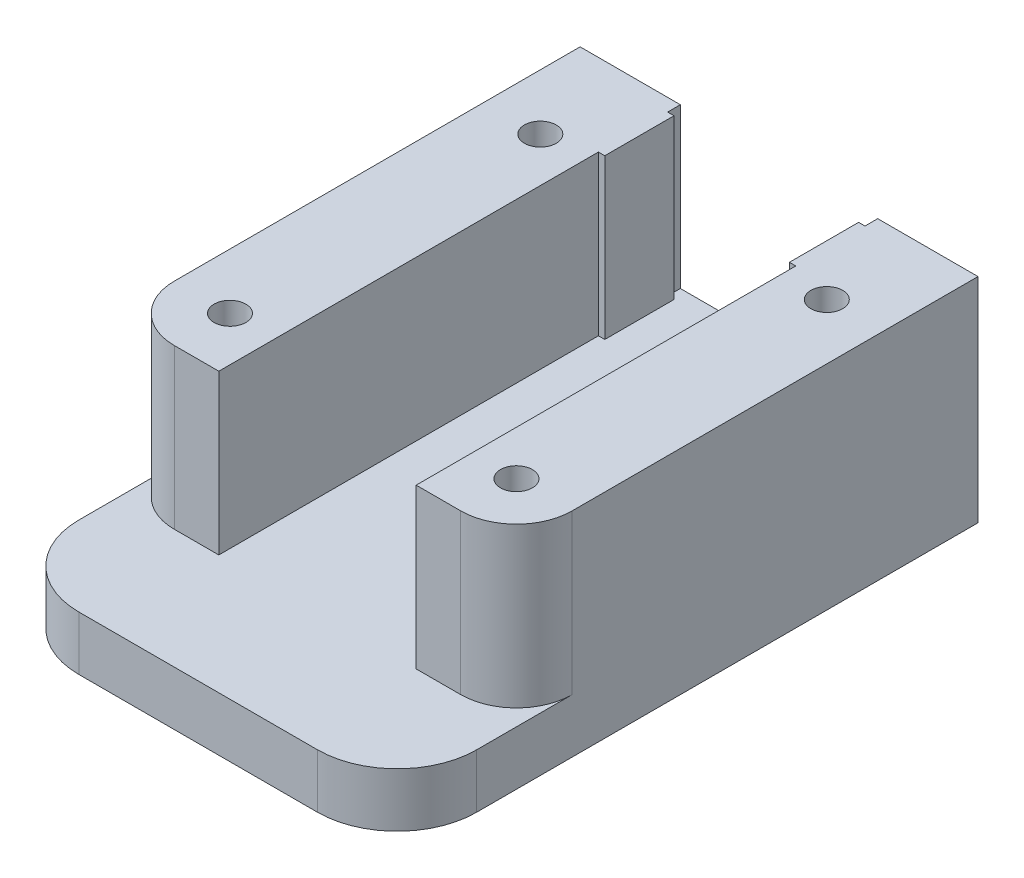
ISO-10303-21;
HEADER;
FILE_DESCRIPTION(('STEP AP214'),'2;1');
FILE_NAME('part.step','',(''),(''),'','','');
FILE_SCHEMA(('AUTOMOTIVE_DESIGN { 1 0 10303 214 1 1 1 1 }'));
ENDSEC;
DATA;
#1=APPLICATION_CONTEXT('core data for automotive mechanical design processes');
#2=APPLICATION_PROTOCOL_DEFINITION('international standard','automotive_design',2000,#1);
#3=PRODUCT_CONTEXT('',#1,'mechanical');
#4=PRODUCT('Part','Part','',(#3));
#5=PRODUCT_RELATED_PRODUCT_CATEGORY('part','',(#4));
#6=PRODUCT_DEFINITION_FORMATION('','',#4);
#7=PRODUCT_DEFINITION_CONTEXT('part definition',#1,'design');
#8=PRODUCT_DEFINITION('design','',#6,#7);
#9=PRODUCT_DEFINITION_SHAPE('','',#8);
#10=(LENGTH_UNIT() NAMED_UNIT(*) SI_UNIT(.MILLI.,.METRE.));
#11=(NAMED_UNIT(*) PLANE_ANGLE_UNIT() SI_UNIT($,.RADIAN.));
#12=(NAMED_UNIT(*) SI_UNIT($,.STERADIAN.) SOLID_ANGLE_UNIT());
#13=UNCERTAINTY_MEASURE_WITH_UNIT(LENGTH_MEASURE(1.E-05),#10,'distance_accuracy_value','');
#14=(GEOMETRIC_REPRESENTATION_CONTEXT(3) GLOBAL_UNCERTAINTY_ASSIGNED_CONTEXT((#13)) GLOBAL_UNIT_ASSIGNED_CONTEXT((#10,
#11,#12)) REPRESENTATION_CONTEXT('',''));
#15=CARTESIAN_POINT('',(0.,0.,0.));
#16=DIRECTION('',(0.,0.,1.));
#17=DIRECTION('',(1.,0.,0.));
#18=AXIS2_PLACEMENT_3D('',#15,#16,#17);
#19=CARTESIAN_POINT('',(-15.,1.6,0.));
#20=DIRECTION('',(0.,0.,1.));
#21=DIRECTION('',(1.,0.,0.));
#22=AXIS2_PLACEMENT_3D('',#19,#20,#21);
#23=PLANE('',#22);
#24=DIRECTION('',(1.,0.,0.));
#25=VECTOR('',#24,1.);
#26=CARTESIAN_POINT('',(-15.,1.6,0.));
#27=LINE('',#26,#25);
#28=CARTESIAN_POINT('',(-12.5,1.6,0.));
#29=VERTEX_POINT('',#28);
#30=CARTESIAN_POINT('',(12.5,1.6,0.));
#31=VERTEX_POINT('',#30);
#32=EDGE_CURVE('E188',#29,#31,#27,.T.);
#33=ORIENTED_EDGE('',*,*,#32,.F.);
#34=DIRECTION('',(0.,-1.,0.));
#35=VECTOR('',#34,1.);
#36=CARTESIAN_POINT('',(-12.5,5.,0.));
#37=LINE('',#36,#35);
#38=CARTESIAN_POINT('',(-12.5,15.,0.));
#39=VERTEX_POINT('',#38);
#40=EDGE_CURVE('E201',#39,#29,#37,.T.);
#41=ORIENTED_EDGE('',*,*,#40,.F.);
#42=DIRECTION('',(-1.,0.,0.));
#43=VECTOR('',#42,1.);
#44=CARTESIAN_POINT('',(-12.5,15.,0.));
#45=LINE('',#44,#43);
#46=CARTESIAN_POINT('',(-6.2,15.,0.));
#47=VERTEX_POINT('',#46);
#48=EDGE_CURVE('E256',#47,#39,#45,.T.);
#49=ORIENTED_EDGE('',*,*,#48,.F.);
#50=DIRECTION('',(0.,-1.,0.));
#51=VECTOR('',#50,1.);
#52=CARTESIAN_POINT('',(-6.2,15.,0.));
#53=LINE('',#52,#51);
#54=CARTESIAN_POINT('',(-6.2,5.,0.));
#55=VERTEX_POINT('',#54);
#56=EDGE_CURVE('E196',#47,#55,#53,.T.);
#57=ORIENTED_EDGE('',*,*,#56,.T.);
#58=DIRECTION('',(-1.,0.,0.));
#59=VECTOR('',#58,1.);
#60=CARTESIAN_POINT('',(-12.5,5.,0.));
#61=LINE('',#60,#59);
#62=CARTESIAN_POINT('',(6.2,5.,0.));
#63=VERTEX_POINT('',#62);
#64=EDGE_CURVE('E231',#63,#55,#61,.T.);
#65=ORIENTED_EDGE('',*,*,#64,.F.);
#66=DIRECTION('',(0.,-1.,0.));
#67=VECTOR('',#66,1.);
#68=CARTESIAN_POINT('',(6.2,15.,0.));
#69=LINE('',#68,#67);
#70=CARTESIAN_POINT('',(6.2,15.,0.));
#71=VERTEX_POINT('',#70);
#72=EDGE_CURVE('E262',#71,#63,#69,.T.);
#73=ORIENTED_EDGE('',*,*,#72,.F.);
#74=DIRECTION('',(-1.,0.,0.));
#75=VECTOR('',#74,1.);
#76=CARTESIAN_POINT('',(12.5,15.,0.));
#77=LINE('',#76,#75);
#78=CARTESIAN_POINT('',(12.5,15.,0.));
#79=VERTEX_POINT('',#78);
#80=EDGE_CURVE('E301',#79,#71,#77,.T.);
#81=ORIENTED_EDGE('',*,*,#80,.F.);
#82=DIRECTION('',(0.,-1.,0.));
#83=VECTOR('',#82,1.);
#84=CARTESIAN_POINT('',(12.5,5.,0.));
#85=LINE('',#84,#83);
#86=EDGE_CURVE('E205',#79,#31,#85,.T.);
#87=ORIENTED_EDGE('',*,*,#86,.T.);
#88=EDGE_LOOP('',(#33,#41,#49,#57,#65,#73,#81,#87));
#89=FACE_BOUND('',#88,.T.);
#90=ADVANCED_FACE('F33',(#89),#23,.F.);
#91=CARTESIAN_POINT('',(-9.,0.,6.));
#92=DIRECTION('',(0.,1.,0.));
#93=DIRECTION('',(0.,0.,1.));
#94=AXIS2_PLACEMENT_3D('',#91,#92,#93);
#95=CYLINDRICAL_SURFACE('',#94,1.);
#96=CARTESIAN_POINT('',(-9.,15.,6.));
#97=DIRECTION('',(0.,1.,0.));
#98=DIRECTION('',(0.,0.,1.));
#99=AXIS2_PLACEMENT_3D('',#96,#97,#98);
#100=CIRCLE('',#99,1.);
#101=CARTESIAN_POINT('',(-9.,15.,7.));
#102=VERTEX_POINT('',#101);
#103=EDGE_CURVE('E369',#102,#102,#100,.T.);
#104=ORIENTED_EDGE('',*,*,#103,.T.);
#105=EDGE_LOOP('',(#104));
#106=FACE_BOUND('',#105,.T.);
#107=CARTESIAN_POINT('',(-9.,1.6,6.));
#108=DIRECTION('',(0.,-1.,0.));
#109=DIRECTION('',(0.,0.,-1.));
#110=AXIS2_PLACEMENT_3D('',#107,#108,#109);
#111=CIRCLE('',#110,1.);
#112=CARTESIAN_POINT('',(-9.,1.6,5.));
#113=VERTEX_POINT('',#112);
#114=EDGE_CURVE('E207',#113,#113,#111,.F.);
#115=ORIENTED_EDGE('',*,*,#114,.F.);
#116=EDGE_LOOP('',(#115));
#117=FACE_BOUND('',#116,.T.);
#118=ADVANCED_FACE('F486',(#106,#117),#95,.F.);
#119=CARTESIAN_POINT('',(9.,0.,6.));
#120=DIRECTION('',(0.,1.,0.));
#121=DIRECTION('',(0.,0.,1.));
#122=AXIS2_PLACEMENT_3D('',#119,#120,#121);
#123=CYLINDRICAL_SURFACE('',#122,1.);
#124=CARTESIAN_POINT('',(9.,15.,6.));
#125=DIRECTION('',(0.,1.,0.));
#126=DIRECTION('',(0.,0.,1.));
#127=AXIS2_PLACEMENT_3D('',#124,#125,#126);
#128=CIRCLE('',#127,1.);
#129=CARTESIAN_POINT('',(9.,15.,7.));
#130=VERTEX_POINT('',#129);
#131=EDGE_CURVE('E206',#130,#130,#128,.T.);
#132=ORIENTED_EDGE('',*,*,#131,.T.);
#133=EDGE_LOOP('',(#132));
#134=FACE_BOUND('',#133,.T.);
#135=CARTESIAN_POINT('',(9.,1.6,6.));
#136=DIRECTION('',(0.,-1.,0.));
#137=DIRECTION('',(0.,0.,-1.));
#138=AXIS2_PLACEMENT_3D('',#135,#136,#137);
#139=CIRCLE('',#138,1.);
#140=CARTESIAN_POINT('',(9.,1.6,5.));
#141=VERTEX_POINT('',#140);
#142=EDGE_CURVE('E37',#141,#141,#139,.F.);
#143=ORIENTED_EDGE('',*,*,#142,.F.);
#144=EDGE_LOOP('',(#143));
#145=FACE_BOUND('',#144,.T.);
#146=ADVANCED_FACE('F491',(#134,#145),#123,.F.);
#147=CARTESIAN_POINT('',(0.,5.,0.));
#148=DIRECTION('',(0.,-1.,0.));
#149=DIRECTION('',(0.,0.,-1.));
#150=AXIS2_PLACEMENT_3D('',#147,#148,#149);
#151=PLANE('',#150);
#152=DIRECTION('',(-1.,0.,0.));
#153=VECTOR('',#152,1.);
#154=CARTESIAN_POINT('',(6.2,5.,0.799999999999998));
#155=LINE('',#154,#153);
#156=CARTESIAN_POINT('',(6.2,5.,0.799999999999998));
#157=VERTEX_POINT('',#156);
#158=CARTESIAN_POINT('',(5.8,5.,0.799999999999998));
#159=VERTEX_POINT('',#158);
#160=EDGE_CURVE('E297',#157,#159,#155,.T.);
#161=ORIENTED_EDGE('',*,*,#160,.F.);
#162=DIRECTION('',(0.,0.,1.));
#163=VECTOR('',#162,1.);
#164=CARTESIAN_POINT('',(6.2,5.,0.));
#165=LINE('',#164,#163);
#166=EDGE_CURVE('E280',#63,#157,#165,.T.);
#167=ORIENTED_EDGE('',*,*,#166,.F.);
#168=ORIENTED_EDGE('',*,*,#64,.T.);
#169=DIRECTION('',(0.,0.,-1.));
#170=VECTOR('',#169,1.);
#171=CARTESIAN_POINT('',(-6.2,5.,0.));
#172=LINE('',#171,#170);
#173=CARTESIAN_POINT('',(-6.2,5.,0.799999999999999));
#174=VERTEX_POINT('',#173);
#175=EDGE_CURVE('E261',#174,#55,#172,.T.);
#176=ORIENTED_EDGE('',*,*,#175,.F.);
#177=DIRECTION('',(-1.,0.,0.));
#178=VECTOR('',#177,1.);
#179=CARTESIAN_POINT('',(-6.2,5.,0.799999999999999));
#180=LINE('',#179,#178);
#181=CARTESIAN_POINT('',(-5.8,5.,0.799999999999999));
#182=VERTEX_POINT('',#181);
#183=EDGE_CURVE('E393',#182,#174,#180,.T.);
#184=ORIENTED_EDGE('',*,*,#183,.F.);
#185=DIRECTION('',(0.,0.,-1.));
#186=VECTOR('',#185,1.);
#187=CARTESIAN_POINT('',(-5.8,5.,0.799999999999999));
#188=LINE('',#187,#186);
#189=CARTESIAN_POINT('',(-5.8,5.,5.15));
#190=VERTEX_POINT('',#189);
#191=EDGE_CURVE('E396',#190,#182,#188,.T.);
#192=ORIENTED_EDGE('',*,*,#191,.F.);
#193=DIRECTION('',(1.,0.,0.));
#194=VECTOR('',#193,1.);
#195=CARTESIAN_POINT('',(-6.2,5.,5.15));
#196=LINE('',#195,#194);
#197=CARTESIAN_POINT('',(-6.2,5.,5.15));
#198=VERTEX_POINT('',#197);
#199=EDGE_CURVE('E400',#198,#190,#196,.T.);
#200=ORIENTED_EDGE('',*,*,#199,.F.);
#201=CARTESIAN_POINT('',(-6.2,5.,29.));
#202=VERTEX_POINT('',#201);
#203=EDGE_CURVE('E260',#202,#198,#172,.T.);
#204=ORIENTED_EDGE('',*,*,#203,.F.);
#205=DIRECTION('',(-1.,0.,0.));
#206=VECTOR('',#205,1.);
#207=CARTESIAN_POINT('',(-9.,5.,29.));
#208=LINE('',#207,#206);
#209=CARTESIAN_POINT('',(-9.,5.,29.));
#210=VERTEX_POINT('',#209);
#211=EDGE_CURVE('E422',#202,#210,#208,.T.);
#212=ORIENTED_EDGE('',*,*,#211,.T.);
#213=CARTESIAN_POINT('',(-9.,5.,25.5));
#214=DIRECTION('',(0.,-1.,0.));
#215=DIRECTION('',(0.,0.,-1.));
#216=AXIS2_PLACEMENT_3D('',#213,#214,#215);
#217=CIRCLE('',#216,3.5);
#218=CARTESIAN_POINT('',(-12.5,5.,25.5));
#219=VERTEX_POINT('',#218);
#220=EDGE_CURVE('E342',#210,#219,#217,.T.);
#221=ORIENTED_EDGE('',*,*,#220,.T.);
#222=DIRECTION('',(0.,0.,1.));
#223=VECTOR('',#222,1.);
#224=CARTESIAN_POINT('',(-12.5,5.,36.5));
#225=LINE('',#224,#223);
#226=CARTESIAN_POINT('',(-12.5,5.,31.5));
#227=VERTEX_POINT('',#226);
#228=EDGE_CURVE('E219',#219,#227,#225,.T.);
#229=ORIENTED_EDGE('',*,*,#228,.T.);
#230=CARTESIAN_POINT('',(-7.5,5.,31.5));
#231=DIRECTION('',(0.,-1.,0.));
#232=DIRECTION('',(0.,0.,-1.));
#233=AXIS2_PLACEMENT_3D('',#230,#231,#232);
#234=CIRCLE('',#233,5.);
#235=CARTESIAN_POINT('',(-7.5,5.,36.5));
#236=VERTEX_POINT('',#235);
#237=EDGE_CURVE('E447',#227,#236,#234,.F.);
#238=ORIENTED_EDGE('',*,*,#237,.T.);
#239=DIRECTION('',(1.,0.,0.));
#240=VECTOR('',#239,1.);
#241=CARTESIAN_POINT('',(-12.5,5.,36.5));
#242=LINE('',#241,#240);
#243=CARTESIAN_POINT('',(7.50000000000001,5.,36.5));
#244=VERTEX_POINT('',#243);
#245=EDGE_CURVE('E214',#236,#244,#242,.T.);
#246=ORIENTED_EDGE('',*,*,#245,.T.);
#247=CARTESIAN_POINT('',(7.50000000000001,5.,31.5));
#248=DIRECTION('',(0.,-1.,0.));
#249=DIRECTION('',(0.,0.,-1.));
#250=AXIS2_PLACEMENT_3D('',#247,#248,#249);
#251=CIRCLE('',#250,5.);
#252=CARTESIAN_POINT('',(12.5,5.,31.5));
#253=VERTEX_POINT('',#252);
#254=EDGE_CURVE('E42',#244,#253,#251,.F.);
#255=ORIENTED_EDGE('',*,*,#254,.T.);
#256=DIRECTION('',(0.,0.,-1.));
#257=VECTOR('',#256,1.);
#258=CARTESIAN_POINT('',(12.5,5.,36.5));
#259=LINE('',#258,#257);
#260=CARTESIAN_POINT('',(12.5,5.,25.5));
#261=VERTEX_POINT('',#260);
#262=EDGE_CURVE('E243',#253,#261,#259,.T.);
#263=ORIENTED_EDGE('',*,*,#262,.T.);
#264=CARTESIAN_POINT('',(9.,5.,25.5));
#265=DIRECTION('',(0.,-1.,0.));
#266=DIRECTION('',(0.,0.,-1.));
#267=AXIS2_PLACEMENT_3D('',#264,#265,#266);
#268=CIRCLE('',#267,3.5);
#269=CARTESIAN_POINT('',(9.,5.,29.));
#270=VERTEX_POINT('',#269);
#271=EDGE_CURVE('E423',#261,#270,#268,.T.);
#272=ORIENTED_EDGE('',*,*,#271,.T.);
#273=CARTESIAN_POINT('',(6.2,5.,29.));
#274=VERTEX_POINT('',#273);
#275=EDGE_CURVE('E420',#270,#274,#208,.T.);
#276=ORIENTED_EDGE('',*,*,#275,.T.);
#277=CARTESIAN_POINT('',(6.2,5.,5.15));
#278=VERTEX_POINT('',#277);
#279=EDGE_CURVE('E300',#278,#274,#165,.T.);
#280=ORIENTED_EDGE('',*,*,#279,.F.);
#281=DIRECTION('',(1.,0.,0.));
#282=VECTOR('',#281,1.);
#283=CARTESIAN_POINT('',(6.2,5.,5.15));
#284=LINE('',#283,#282);
#285=CARTESIAN_POINT('',(5.8,5.,5.15));
#286=VERTEX_POINT('',#285);
#287=EDGE_CURVE('E373',#286,#278,#284,.T.);
#288=ORIENTED_EDGE('',*,*,#287,.F.);
#289=DIRECTION('',(0.,0.,1.));
#290=VECTOR('',#289,1.);
#291=CARTESIAN_POINT('',(5.8,5.,0.799999999999998));
#292=LINE('',#291,#290);
#293=EDGE_CURVE('E376',#159,#286,#292,.T.);
#294=ORIENTED_EDGE('',*,*,#293,.F.);
#295=EDGE_LOOP('',(#161,#167,#168,#176,#184,#192,#200,#204,#212,#221,#229,#238,#246,#255,#263,
#272,#276,#280,#288,#294));
#296=FACE_BOUND('',#295,.T.);
#297=ADVANCED_FACE('F293',(#296),#151,.F.);
#298=CARTESIAN_POINT('',(6.2,15.,0.));
#299=DIRECTION('',(1.,0.,0.));
#300=DIRECTION('',(0.,0.,-1.));
#301=AXIS2_PLACEMENT_3D('',#298,#299,#300);
#302=PLANE('',#301);
#303=DIRECTION('',(0.,-1.,0.));
#304=VECTOR('',#303,1.);
#305=CARTESIAN_POINT('',(6.2,19.3683520920365,0.799999999999998));
#306=LINE('',#305,#304);
#307=CARTESIAN_POINT('',(6.2,15.,0.799999999999998));
#308=VERTEX_POINT('',#307);
#309=EDGE_CURVE('E381',#308,#157,#306,.T.);
#310=ORIENTED_EDGE('',*,*,#309,.F.);
#311=DIRECTION('',(0.,0.,1.));
#312=VECTOR('',#311,1.);
#313=CARTESIAN_POINT('',(6.2,15.,0.));
#314=LINE('',#313,#312);
#315=EDGE_CURVE('E269',#71,#308,#314,.T.);
#316=ORIENTED_EDGE('',*,*,#315,.F.);
#317=ORIENTED_EDGE('',*,*,#72,.T.);
#318=ORIENTED_EDGE('',*,*,#166,.T.);
#319=EDGE_LOOP('',(#310,#316,#317,#318));
#320=FACE_BOUND('',#319,.T.);
#321=ADVANCED_FACE('F511',(#320),#302,.F.);
#322=DIRECTION('',(0.,-1.,0.));
#323=VECTOR('',#322,1.);
#324=CARTESIAN_POINT('',(6.2,19.3683520920365,5.15));
#325=LINE('',#324,#323);
#326=CARTESIAN_POINT('',(6.2,15.,5.15));
#327=VERTEX_POINT('',#326);
#328=EDGE_CURVE('E372',#327,#278,#325,.T.);
#329=ORIENTED_EDGE('',*,*,#328,.T.);
#330=ORIENTED_EDGE('',*,*,#279,.T.);
#331=DIRECTION('',(0.,1.,0.));
#332=VECTOR('',#331,1.);
#333=CARTESIAN_POINT('',(6.2,15.,29.));
#334=LINE('',#333,#332);
#335=CARTESIAN_POINT('',(6.2,15.,29.));
#336=VERTEX_POINT('',#335);
#337=EDGE_CURVE('E328',#274,#336,#334,.T.);
#338=ORIENTED_EDGE('',*,*,#337,.T.);
#339=EDGE_CURVE('E276',#327,#336,#314,.T.);
#340=ORIENTED_EDGE('',*,*,#339,.F.);
#341=EDGE_LOOP('',(#329,#330,#338,#340));
#342=FACE_BOUND('',#341,.T.);
#343=ADVANCED_FACE('F335',(#342),#302,.F.);
#344=CARTESIAN_POINT('',(-6.2,15.,0.));
#345=DIRECTION('',(-1.,0.,0.));
#346=DIRECTION('',(0.,0.,1.));
#347=AXIS2_PLACEMENT_3D('',#344,#345,#346);
#348=PLANE('',#347);
#349=DIRECTION('',(0.,-1.,0.));
#350=VECTOR('',#349,1.);
#351=CARTESIAN_POINT('',(-6.2,19.3683520920365,5.15));
#352=LINE('',#351,#350);
#353=CARTESIAN_POINT('',(-6.2,15.,5.15));
#354=VERTEX_POINT('',#353);
#355=EDGE_CURVE('E403',#354,#198,#352,.T.);
#356=ORIENTED_EDGE('',*,*,#355,.F.);
#357=DIRECTION('',(0.,0.,-1.));
#358=VECTOR('',#357,1.);
#359=CARTESIAN_POINT('',(-6.2,15.,0.));
#360=LINE('',#359,#358);
#361=CARTESIAN_POINT('',(-6.2,15.,29.));
#362=VERTEX_POINT('',#361);
#363=EDGE_CURVE('E282',#362,#354,#360,.T.);
#364=ORIENTED_EDGE('',*,*,#363,.F.);
#365=DIRECTION('',(0.,-1.,0.));
#366=VECTOR('',#365,1.);
#367=CARTESIAN_POINT('',(-6.2,15.,29.));
#368=LINE('',#367,#366);
#369=EDGE_CURVE('E336',#362,#202,#368,.T.);
#370=ORIENTED_EDGE('',*,*,#369,.T.);
#371=ORIENTED_EDGE('',*,*,#203,.T.);
#372=EDGE_LOOP('',(#356,#364,#370,#371));
#373=FACE_BOUND('',#372,.T.);
#374=ADVANCED_FACE('F464',(#373),#348,.F.);
#375=DIRECTION('',(0.,-1.,0.));
#376=VECTOR('',#375,1.);
#377=CARTESIAN_POINT('',(-6.2,19.3683520920365,0.799999999999999));
#378=LINE('',#377,#376);
#379=CARTESIAN_POINT('',(-6.2,15.,0.799999999999999));
#380=VERTEX_POINT('',#379);
#381=EDGE_CURVE('E384',#380,#174,#378,.T.);
#382=ORIENTED_EDGE('',*,*,#381,.T.);
#383=ORIENTED_EDGE('',*,*,#175,.T.);
#384=ORIENTED_EDGE('',*,*,#56,.F.);
#385=EDGE_CURVE('E281',#380,#47,#360,.T.);
#386=ORIENTED_EDGE('',*,*,#385,.F.);
#387=EDGE_LOOP('',(#382,#383,#384,#386));
#388=FACE_BOUND('',#387,.T.);
#389=ADVANCED_FACE('F290',(#388),#348,.F.);
#390=CARTESIAN_POINT('',(0.,15.,0.));
#391=DIRECTION('',(0.,1.,0.));
#392=DIRECTION('',(0.,0.,1.));
#393=AXIS2_PLACEMENT_3D('',#390,#391,#392);
#394=PLANE('',#393);
#395=ORIENTED_EDGE('',*,*,#103,.F.);
#396=EDGE_LOOP('',(#395));
#397=FACE_BOUND('',#396,.T.);
#398=CARTESIAN_POINT('',(-9.,15.,25.5));
#399=DIRECTION('',(0.,1.,0.));
#400=DIRECTION('',(0.,0.,1.));
#401=AXIS2_PLACEMENT_3D('',#398,#399,#400);
#402=CIRCLE('',#401,1.);
#403=CARTESIAN_POINT('',(-9.,15.,26.5));
#404=VERTEX_POINT('',#403);
#405=EDGE_CURVE('E310',#404,#404,#402,.T.);
#406=ORIENTED_EDGE('',*,*,#405,.F.);
#407=EDGE_LOOP('',(#406));
#408=FACE_BOUND('',#407,.T.);
#409=DIRECTION('',(-1.,0.,0.));
#410=VECTOR('',#409,1.);
#411=CARTESIAN_POINT('',(-9.,15.,29.));
#412=LINE('',#411,#410);
#413=CARTESIAN_POINT('',(-9.,15.,29.));
#414=VERTEX_POINT('',#413);
#415=EDGE_CURVE('E333',#362,#414,#412,.T.);
#416=ORIENTED_EDGE('',*,*,#415,.F.);
#417=ORIENTED_EDGE('',*,*,#363,.T.);
#418=DIRECTION('',(1.,0.,0.));
#419=VECTOR('',#418,1.);
#420=CARTESIAN_POINT('',(-6.2,15.,5.15));
#421=LINE('',#420,#419);
#422=CARTESIAN_POINT('',(-5.8,15.,5.15));
#423=VERTEX_POINT('',#422);
#424=EDGE_CURVE('E407',#354,#423,#421,.T.);
#425=ORIENTED_EDGE('',*,*,#424,.T.);
#426=DIRECTION('',(0.,0.,-1.));
#427=VECTOR('',#426,1.);
#428=CARTESIAN_POINT('',(-5.8,15.,0.799999999999999));
#429=LINE('',#428,#427);
#430=CARTESIAN_POINT('',(-5.8,15.,0.799999999999999));
#431=VERTEX_POINT('',#430);
#432=EDGE_CURVE('E404',#423,#431,#429,.T.);
#433=ORIENTED_EDGE('',*,*,#432,.T.);
#434=DIRECTION('',(-1.,0.,0.));
#435=VECTOR('',#434,1.);
#436=CARTESIAN_POINT('',(-6.2,15.,0.799999999999999));
#437=LINE('',#436,#435);
#438=EDGE_CURVE('E58',#431,#380,#437,.T.);
#439=ORIENTED_EDGE('',*,*,#438,.T.);
#440=ORIENTED_EDGE('',*,*,#385,.T.);
#441=ORIENTED_EDGE('',*,*,#48,.T.);
#442=DIRECTION('',(0.,0.,1.));
#443=VECTOR('',#442,1.);
#444=CARTESIAN_POINT('',(-12.5,15.,0.));
#445=LINE('',#444,#443);
#446=CARTESIAN_POINT('',(-12.5,15.,25.5));
#447=VERTEX_POINT('',#446);
#448=EDGE_CURVE('E213',#39,#447,#445,.T.);
#449=ORIENTED_EDGE('',*,*,#448,.T.);
#450=CARTESIAN_POINT('',(-9.,15.,25.5));
#451=DIRECTION('',(0.,-1.,0.));
#452=DIRECTION('',(0.,0.,1.));
#453=AXIS2_PLACEMENT_3D('',#450,#451,#452);
#454=CIRCLE('',#453,3.5);
#455=EDGE_CURVE('E406',#414,#447,#454,.T.);
#456=ORIENTED_EDGE('',*,*,#455,.F.);
#457=EDGE_LOOP('',(#416,#417,#425,#433,#439,#440,#441,#449,#456));
#458=FACE_BOUND('',#457,.T.);
#459=ADVANCED_FACE('F288',(#397,#408,#458),#394,.T.);
#460=CARTESIAN_POINT('',(12.5,5.,36.5));
#461=DIRECTION('',(-1.,0.,0.));
#462=DIRECTION('',(0.,0.,1.));
#463=AXIS2_PLACEMENT_3D('',#460,#461,#462);
#464=PLANE('',#463);
#465=DIRECTION('',(0.,1.,0.));
#466=VECTOR('',#465,1.);
#467=CARTESIAN_POINT('',(12.5,-31.3123526487911,25.5));
#468=LINE('',#467,#466);
#469=CARTESIAN_POINT('',(12.5,15.,25.5));
#470=VERTEX_POINT('',#469);
#471=EDGE_CURVE('E332',#261,#470,#468,.T.);
#472=ORIENTED_EDGE('',*,*,#471,.F.);
#473=ORIENTED_EDGE('',*,*,#262,.F.);
#474=DIRECTION('',(0.,-1.,0.));
#475=VECTOR('',#474,1.);
#476=CARTESIAN_POINT('',(12.5,5.,31.5));
#477=LINE('',#476,#475);
#478=CARTESIAN_POINT('',(12.5,1.6,31.5));
#479=VERTEX_POINT('',#478);
#480=EDGE_CURVE('E241',#253,#479,#477,.T.);
#481=ORIENTED_EDGE('',*,*,#480,.T.);
#482=DIRECTION('',(0.,0.,-1.));
#483=VECTOR('',#482,1.);
#484=CARTESIAN_POINT('',(12.5,1.6,36.5));
#485=LINE('',#484,#483);
#486=EDGE_CURVE('E216',#479,#31,#485,.T.);
#487=ORIENTED_EDGE('',*,*,#486,.T.);
#488=ORIENTED_EDGE('',*,*,#86,.F.);
#489=DIRECTION('',(0.,0.,-1.));
#490=VECTOR('',#489,1.);
#491=CARTESIAN_POINT('',(12.5,15.,0.));
#492=LINE('',#491,#490);
#493=EDGE_CURVE('E299',#470,#79,#492,.T.);
#494=ORIENTED_EDGE('',*,*,#493,.F.);
#495=EDGE_LOOP('',(#472,#473,#481,#487,#488,#494));
#496=FACE_BOUND('',#495,.T.);
#497=ADVANCED_FACE('F431',(#496),#464,.F.);
#498=CARTESIAN_POINT('',(-12.5,5.,36.5));
#499=DIRECTION('',(1.,0.,0.));
#500=DIRECTION('',(0.,0.,-1.));
#501=AXIS2_PLACEMENT_3D('',#498,#499,#500);
#502=PLANE('',#501);
#503=ORIENTED_EDGE('',*,*,#228,.F.);
#504=DIRECTION('',(0.,1.,0.));
#505=VECTOR('',#504,1.);
#506=CARTESIAN_POINT('',(-12.5,-31.3123526487911,25.5));
#507=LINE('',#506,#505);
#508=EDGE_CURVE('E337',#219,#447,#507,.T.);
#509=ORIENTED_EDGE('',*,*,#508,.T.);
#510=ORIENTED_EDGE('',*,*,#448,.F.);
#511=ORIENTED_EDGE('',*,*,#40,.T.);
#512=DIRECTION('',(0.,0.,1.));
#513=VECTOR('',#512,1.);
#514=CARTESIAN_POINT('',(-12.5,1.6,36.5));
#515=LINE('',#514,#513);
#516=CARTESIAN_POINT('',(-12.5,1.6,31.5));
#517=VERTEX_POINT('',#516);
#518=EDGE_CURVE('E184',#29,#517,#515,.T.);
#519=ORIENTED_EDGE('',*,*,#518,.T.);
#520=DIRECTION('',(0.,-1.,0.));
#521=VECTOR('',#520,1.);
#522=CARTESIAN_POINT('',(-12.5,5.,31.5));
#523=LINE('',#522,#521);
#524=EDGE_CURVE('E11',#517,#227,#523,.F.);
#525=ORIENTED_EDGE('',*,*,#524,.T.);
#526=EDGE_LOOP('',(#503,#509,#510,#511,#519,#525));
#527=FACE_BOUND('',#526,.T.);
#528=ADVANCED_FACE('F210',(#527),#502,.F.);
#529=CARTESIAN_POINT('',(-12.5,5.,36.5));
#530=DIRECTION('',(0.,0.,-1.));
#531=DIRECTION('',(-1.,0.,0.));
#532=AXIS2_PLACEMENT_3D('',#529,#530,#531);
#533=PLANE('',#532);
#534=DIRECTION('',(1.,0.,0.));
#535=VECTOR('',#534,1.);
#536=CARTESIAN_POINT('',(-12.5,1.6,36.5));
#537=LINE('',#536,#535);
#538=CARTESIAN_POINT('',(-7.5,1.6,36.5));
#539=VERTEX_POINT('',#538);
#540=CARTESIAN_POINT('',(7.50000000000001,1.6,36.5));
#541=VERTEX_POINT('',#540);
#542=EDGE_CURVE('E195',#539,#541,#537,.T.);
#543=ORIENTED_EDGE('',*,*,#542,.T.);
#544=DIRECTION('',(0.,-1.,0.));
#545=VECTOR('',#544,1.);
#546=CARTESIAN_POINT('',(7.50000000000001,5.,36.5));
#547=LINE('',#546,#545);
#548=EDGE_CURVE('E439',#541,#244,#547,.F.);
#549=ORIENTED_EDGE('',*,*,#548,.T.);
#550=ORIENTED_EDGE('',*,*,#245,.F.);
#551=DIRECTION('',(0.,-1.,0.));
#552=VECTOR('',#551,1.);
#553=CARTESIAN_POINT('',(-7.5,5.,36.5));
#554=LINE('',#553,#552);
#555=EDGE_CURVE('E440',#236,#539,#554,.T.);
#556=ORIENTED_EDGE('',*,*,#555,.T.);
#557=EDGE_LOOP('',(#543,#549,#550,#556));
#558=FACE_BOUND('',#557,.T.);
#559=ADVANCED_FACE('F354',(#558),#533,.F.);
#560=CARTESIAN_POINT('',(0.,1.6,0.));
#561=DIRECTION('',(0.,-1.,0.));
#562=DIRECTION('',(0.,0.,-1.));
#563=AXIS2_PLACEMENT_3D('',#560,#561,#562);
#564=PLANE('',#563);
#565=CARTESIAN_POINT('',(-7.5,1.6,31.5));
#566=DIRECTION('',(0.,-1.,0.));
#567=DIRECTION('',(0.,0.,-1.));
#568=AXIS2_PLACEMENT_3D('',#565,#566,#567);
#569=CIRCLE('',#568,5.);
#570=EDGE_CURVE('E191',#539,#517,#569,.T.);
#571=ORIENTED_EDGE('',*,*,#570,.T.);
#572=ORIENTED_EDGE('',*,*,#518,.F.);
#573=ORIENTED_EDGE('',*,*,#32,.T.);
#574=ORIENTED_EDGE('',*,*,#486,.F.);
#575=CARTESIAN_POINT('',(7.50000000000001,1.6,31.5));
#576=DIRECTION('',(0.,-1.,0.));
#577=DIRECTION('',(0.,0.,-1.));
#578=AXIS2_PLACEMENT_3D('',#575,#576,#577);
#579=CIRCLE('',#578,5.);
#580=EDGE_CURVE('E435',#479,#541,#579,.T.);
#581=ORIENTED_EDGE('',*,*,#580,.T.);
#582=ORIENTED_EDGE('',*,*,#542,.F.);
#583=EDGE_LOOP('',(#571,#572,#573,#574,#581,#582));
#584=FACE_BOUND('',#583,.T.);
#585=CARTESIAN_POINT('',(9.,1.6,25.5));
#586=DIRECTION('',(0.,-1.,0.));
#587=DIRECTION('',(0.,0.,-1.));
#588=AXIS2_PLACEMENT_3D('',#585,#586,#587);
#589=CIRCLE('',#588,1.);
#590=CARTESIAN_POINT('',(9.,1.6,24.5));
#591=VERTEX_POINT('',#590);
#592=EDGE_CURVE('E315',#591,#591,#589,.T.);
#593=ORIENTED_EDGE('',*,*,#592,.F.);
#594=EDGE_LOOP('',(#593));
#595=FACE_BOUND('',#594,.T.);
#596=CARTESIAN_POINT('',(-9.,1.6,25.5));
#597=DIRECTION('',(0.,-1.,0.));
#598=DIRECTION('',(0.,0.,-1.));
#599=AXIS2_PLACEMENT_3D('',#596,#597,#598);
#600=CIRCLE('',#599,1.);
#601=CARTESIAN_POINT('',(-9.,1.6,24.5));
#602=VERTEX_POINT('',#601);
#603=EDGE_CURVE('E303',#602,#602,#600,.T.);
#604=ORIENTED_EDGE('',*,*,#603,.F.);
#605=EDGE_LOOP('',(#604));
#606=FACE_BOUND('',#605,.T.);
#607=ORIENTED_EDGE('',*,*,#114,.T.);
#608=EDGE_LOOP('',(#607));
#609=FACE_BOUND('',#608,.T.);
#610=ORIENTED_EDGE('',*,*,#142,.T.);
#611=EDGE_LOOP('',(#610));
#612=FACE_BOUND('',#611,.T.);
#613=ADVANCED_FACE('F186',(#584,#595,#606,#609,#612),#564,.T.);
#614=CARTESIAN_POINT('',(0.,15.,0.));
#615=DIRECTION('',(0.,-1.,0.));
#616=DIRECTION('',(0.,0.,-1.));
#617=AXIS2_PLACEMENT_3D('',#614,#615,#616);
#618=PLANE('',#617);
#619=ORIENTED_EDGE('',*,*,#131,.F.);
#620=EDGE_LOOP('',(#619));
#621=FACE_BOUND('',#620,.T.);
#622=CARTESIAN_POINT('',(9.,15.,25.5));
#623=DIRECTION('',(0.,1.,0.));
#624=DIRECTION('',(0.,0.,1.));
#625=AXIS2_PLACEMENT_3D('',#622,#623,#624);
#626=CIRCLE('',#625,1.);
#627=CARTESIAN_POINT('',(9.,15.,26.5));
#628=VERTEX_POINT('',#627);
#629=EDGE_CURVE('E340',#628,#628,#626,.T.);
#630=ORIENTED_EDGE('',*,*,#629,.F.);
#631=EDGE_LOOP('',(#630));
#632=FACE_BOUND('',#631,.T.);
#633=CARTESIAN_POINT('',(9.,15.,29.));
#634=VERTEX_POINT('',#633);
#635=EDGE_CURVE('E324',#634,#336,#412,.T.);
#636=ORIENTED_EDGE('',*,*,#635,.F.);
#637=CARTESIAN_POINT('',(9.,15.,25.5));
#638=DIRECTION('',(0.,-1.,0.));
#639=DIRECTION('',(0.,0.,1.));
#640=AXIS2_PLACEMENT_3D('',#637,#638,#639);
#641=CIRCLE('',#640,3.5);
#642=EDGE_CURVE('E414',#470,#634,#641,.T.);
#643=ORIENTED_EDGE('',*,*,#642,.F.);
#644=ORIENTED_EDGE('',*,*,#493,.T.);
#645=ORIENTED_EDGE('',*,*,#80,.T.);
#646=ORIENTED_EDGE('',*,*,#315,.T.);
#647=DIRECTION('',(-1.,0.,0.));
#648=VECTOR('',#647,1.);
#649=CARTESIAN_POINT('',(6.2,15.,0.799999999999998));
#650=LINE('',#649,#648);
#651=CARTESIAN_POINT('',(5.8,15.,0.799999999999998));
#652=VERTEX_POINT('',#651);
#653=EDGE_CURVE('E385',#308,#652,#650,.T.);
#654=ORIENTED_EDGE('',*,*,#653,.T.);
#655=DIRECTION('',(0.,0.,1.));
#656=VECTOR('',#655,1.);
#657=CARTESIAN_POINT('',(5.8,15.,0.799999999999998));
#658=LINE('',#657,#656);
#659=CARTESIAN_POINT('',(5.8,15.,5.15));
#660=VERTEX_POINT('',#659);
#661=EDGE_CURVE('E382',#652,#660,#658,.T.);
#662=ORIENTED_EDGE('',*,*,#661,.T.);
#663=DIRECTION('',(1.,0.,0.));
#664=VECTOR('',#663,1.);
#665=CARTESIAN_POINT('',(6.2,15.,5.15));
#666=LINE('',#665,#664);
#667=EDGE_CURVE('E50',#660,#327,#666,.T.);
#668=ORIENTED_EDGE('',*,*,#667,.T.);
#669=ORIENTED_EDGE('',*,*,#339,.T.);
#670=EDGE_LOOP('',(#636,#643,#644,#645,#646,#654,#662,#668,#669));
#671=FACE_BOUND('',#670,.T.);
#672=ADVANCED_FACE('F322',(#621,#632,#671),#618,.F.);
#673=CARTESIAN_POINT('',(7.50000000000001,5.,31.5));
#674=DIRECTION('',(0.,-1.,0.));
#675=DIRECTION('',(0.,0.,-1.));
#676=AXIS2_PLACEMENT_3D('',#673,#674,#675);
#677=CYLINDRICAL_SURFACE('',#676,5.);
#678=ORIENTED_EDGE('',*,*,#254,.F.);
#679=ORIENTED_EDGE('',*,*,#548,.F.);
#680=ORIENTED_EDGE('',*,*,#580,.F.);
#681=ORIENTED_EDGE('',*,*,#480,.F.);
#682=EDGE_LOOP('',(#678,#679,#680,#681));
#683=FACE_BOUND('',#682,.T.);
#684=ADVANCED_FACE('F438',(#683),#677,.T.);
#685=CARTESIAN_POINT('',(-7.5,5.,31.5));
#686=DIRECTION('',(0.,-1.,0.));
#687=DIRECTION('',(0.,0.,-1.));
#688=AXIS2_PLACEMENT_3D('',#685,#686,#687);
#689=CYLINDRICAL_SURFACE('',#688,5.);
#690=ORIENTED_EDGE('',*,*,#237,.F.);
#691=ORIENTED_EDGE('',*,*,#524,.F.);
#692=ORIENTED_EDGE('',*,*,#570,.F.);
#693=ORIENTED_EDGE('',*,*,#555,.F.);
#694=EDGE_LOOP('',(#690,#691,#692,#693));
#695=FACE_BOUND('',#694,.T.);
#696=ADVANCED_FACE('F35',(#695),#689,.T.);
#697=CARTESIAN_POINT('',(-9.,0.,25.5));
#698=DIRECTION('',(0.,1.,0.));
#699=DIRECTION('',(0.,0.,1.));
#700=AXIS2_PLACEMENT_3D('',#697,#698,#699);
#701=CYLINDRICAL_SURFACE('',#700,1.);
#702=ORIENTED_EDGE('',*,*,#603,.T.);
#703=EDGE_LOOP('',(#702));
#704=FACE_BOUND('',#703,.T.);
#705=ORIENTED_EDGE('',*,*,#405,.T.);
#706=EDGE_LOOP('',(#705));
#707=FACE_BOUND('',#706,.T.);
#708=ADVANCED_FACE('F501',(#704,#707),#701,.F.);
#709=CARTESIAN_POINT('',(9.,0.,25.5));
#710=DIRECTION('',(0.,1.,0.));
#711=DIRECTION('',(0.,0.,1.));
#712=AXIS2_PLACEMENT_3D('',#709,#710,#711);
#713=CYLINDRICAL_SURFACE('',#712,1.);
#714=ORIENTED_EDGE('',*,*,#592,.T.);
#715=EDGE_LOOP('',(#714));
#716=FACE_BOUND('',#715,.T.);
#717=ORIENTED_EDGE('',*,*,#629,.T.);
#718=EDGE_LOOP('',(#717));
#719=FACE_BOUND('',#718,.T.);
#720=ADVANCED_FACE('F350',(#716,#719),#713,.F.);
#721=CARTESIAN_POINT('',(-9.,-31.3123526487911,29.));
#722=DIRECTION('',(0.,0.,-1.));
#723=DIRECTION('',(-1.,0.,0.));
#724=AXIS2_PLACEMENT_3D('',#721,#722,#723);
#725=PLANE('',#724);
#726=ORIENTED_EDGE('',*,*,#275,.F.);
#727=DIRECTION('',(0.,1.,0.));
#728=VECTOR('',#727,1.);
#729=CARTESIAN_POINT('',(9.,-31.3123526487911,29.));
#730=LINE('',#729,#728);
#731=EDGE_CURVE('E331',#270,#634,#730,.T.);
#732=ORIENTED_EDGE('',*,*,#731,.T.);
#733=ORIENTED_EDGE('',*,*,#635,.T.);
#734=ORIENTED_EDGE('',*,*,#337,.F.);
#735=EDGE_LOOP('',(#726,#732,#733,#734));
#736=FACE_BOUND('',#735,.T.);
#737=ADVANCED_FACE('F327',(#736),#725,.F.);
#738=CARTESIAN_POINT('',(9.,-31.3123526487911,25.5));
#739=DIRECTION('',(0.,1.,0.));
#740=DIRECTION('',(0.,0.,1.));
#741=AXIS2_PLACEMENT_3D('',#738,#739,#740);
#742=CYLINDRICAL_SURFACE('',#741,3.5);
#743=ORIENTED_EDGE('',*,*,#471,.T.);
#744=ORIENTED_EDGE('',*,*,#642,.T.);
#745=ORIENTED_EDGE('',*,*,#731,.F.);
#746=ORIENTED_EDGE('',*,*,#271,.F.);
#747=EDGE_LOOP('',(#743,#744,#745,#746));
#748=FACE_BOUND('',#747,.T.);
#749=ADVANCED_FACE('F428',(#748),#742,.T.);
#750=ORIENTED_EDGE('',*,*,#415,.T.);
#751=DIRECTION('',(0.,1.,0.));
#752=VECTOR('',#751,1.);
#753=CARTESIAN_POINT('',(-9.,-31.3123526487911,29.));
#754=LINE('',#753,#752);
#755=EDGE_CURVE('E419',#210,#414,#754,.T.);
#756=ORIENTED_EDGE('',*,*,#755,.F.);
#757=ORIENTED_EDGE('',*,*,#211,.F.);
#758=ORIENTED_EDGE('',*,*,#369,.F.);
#759=EDGE_LOOP('',(#750,#756,#757,#758));
#760=FACE_BOUND('',#759,.T.);
#761=ADVANCED_FACE('F639',(#760),#725,.F.);
#762=CARTESIAN_POINT('',(-9.,-31.3123526487911,25.5));
#763=DIRECTION('',(0.,1.,0.));
#764=DIRECTION('',(0.,0.,1.));
#765=AXIS2_PLACEMENT_3D('',#762,#763,#764);
#766=CYLINDRICAL_SURFACE('',#765,3.5);
#767=ORIENTED_EDGE('',*,*,#755,.T.);
#768=ORIENTED_EDGE('',*,*,#455,.T.);
#769=ORIENTED_EDGE('',*,*,#508,.F.);
#770=ORIENTED_EDGE('',*,*,#220,.F.);
#771=EDGE_LOOP('',(#767,#768,#769,#770));
#772=FACE_BOUND('',#771,.T.);
#773=ADVANCED_FACE('F458',(#772),#766,.T.);
#774=CARTESIAN_POINT('',(-6.2,19.3683520920365,5.15));
#775=DIRECTION('',(0.,0.,-1.));
#776=DIRECTION('',(-1.,0.,0.));
#777=AXIS2_PLACEMENT_3D('',#774,#775,#776);
#778=PLANE('',#777);
#779=ORIENTED_EDGE('',*,*,#424,.F.);
#780=ORIENTED_EDGE('',*,*,#355,.T.);
#781=ORIENTED_EDGE('',*,*,#199,.T.);
#782=DIRECTION('',(0.,-1.,0.));
#783=VECTOR('',#782,1.);
#784=CARTESIAN_POINT('',(-5.8,19.3683520920365,5.15));
#785=LINE('',#784,#783);
#786=EDGE_CURVE('E399',#423,#190,#785,.T.);
#787=ORIENTED_EDGE('',*,*,#786,.F.);
#788=EDGE_LOOP('',(#779,#780,#781,#787));
#789=FACE_BOUND('',#788,.T.);
#790=ADVANCED_FACE('F467',(#789),#778,.F.);
#791=CARTESIAN_POINT('',(-5.8,19.3683520920365,0.799999999999999));
#792=DIRECTION('',(-1.,0.,0.));
#793=DIRECTION('',(0.,0.,1.));
#794=AXIS2_PLACEMENT_3D('',#791,#792,#793);
#795=PLANE('',#794);
#796=ORIENTED_EDGE('',*,*,#432,.F.);
#797=ORIENTED_EDGE('',*,*,#786,.T.);
#798=ORIENTED_EDGE('',*,*,#191,.T.);
#799=DIRECTION('',(0.,-1.,0.));
#800=VECTOR('',#799,1.);
#801=CARTESIAN_POINT('',(-5.8,19.3683520920365,0.799999999999999));
#802=LINE('',#801,#800);
#803=EDGE_CURVE('E395',#431,#182,#802,.T.);
#804=ORIENTED_EDGE('',*,*,#803,.F.);
#805=EDGE_LOOP('',(#796,#797,#798,#804));
#806=FACE_BOUND('',#805,.T.);
#807=ADVANCED_FACE('F471',(#806),#795,.F.);
#808=CARTESIAN_POINT('',(-6.2,19.3683520920365,0.799999999999999));
#809=DIRECTION('',(0.,0.,1.));
#810=DIRECTION('',(1.,0.,0.));
#811=AXIS2_PLACEMENT_3D('',#808,#809,#810);
#812=PLANE('',#811);
#813=ORIENTED_EDGE('',*,*,#438,.F.);
#814=ORIENTED_EDGE('',*,*,#803,.T.);
#815=ORIENTED_EDGE('',*,*,#183,.T.);
#816=ORIENTED_EDGE('',*,*,#381,.F.);
#817=EDGE_LOOP('',(#813,#814,#815,#816));
#818=FACE_BOUND('',#817,.T.);
#819=ADVANCED_FACE('F473',(#818),#812,.F.);
#820=CARTESIAN_POINT('',(6.2,19.3683520920365,0.799999999999998));
#821=DIRECTION('',(0.,0.,1.));
#822=DIRECTION('',(1.,0.,0.));
#823=AXIS2_PLACEMENT_3D('',#820,#821,#822);
#824=PLANE('',#823);
#825=ORIENTED_EDGE('',*,*,#653,.F.);
#826=ORIENTED_EDGE('',*,*,#309,.T.);
#827=ORIENTED_EDGE('',*,*,#160,.T.);
#828=DIRECTION('',(0.,-1.,0.));
#829=VECTOR('',#828,1.);
#830=CARTESIAN_POINT('',(5.8,19.3683520920365,0.799999999999998));
#831=LINE('',#830,#829);
#832=EDGE_CURVE('E379',#652,#159,#831,.T.);
#833=ORIENTED_EDGE('',*,*,#832,.F.);
#834=EDGE_LOOP('',(#825,#826,#827,#833));
#835=FACE_BOUND('',#834,.T.);
#836=ADVANCED_FACE('F475',(#835),#824,.F.);
#837=CARTESIAN_POINT('',(5.8,19.3683520920365,0.799999999999998));
#838=DIRECTION('',(1.,0.,0.));
#839=DIRECTION('',(0.,0.,-1.));
#840=AXIS2_PLACEMENT_3D('',#837,#838,#839);
#841=PLANE('',#840);
#842=ORIENTED_EDGE('',*,*,#661,.F.);
#843=ORIENTED_EDGE('',*,*,#832,.T.);
#844=ORIENTED_EDGE('',*,*,#293,.T.);
#845=DIRECTION('',(0.,-1.,0.));
#846=VECTOR('',#845,1.);
#847=CARTESIAN_POINT('',(5.8,19.3683520920365,5.15));
#848=LINE('',#847,#846);
#849=EDGE_CURVE('E375',#660,#286,#848,.T.);
#850=ORIENTED_EDGE('',*,*,#849,.F.);
#851=EDGE_LOOP('',(#842,#843,#844,#850));
#852=FACE_BOUND('',#851,.T.);
#853=ADVANCED_FACE('F481',(#852),#841,.F.);
#854=CARTESIAN_POINT('',(6.2,19.3683520920365,5.15));
#855=DIRECTION('',(0.,0.,-1.));
#856=DIRECTION('',(-1.,0.,0.));
#857=AXIS2_PLACEMENT_3D('',#854,#855,#856);
#858=PLANE('',#857);
#859=ORIENTED_EDGE('',*,*,#667,.F.);
#860=ORIENTED_EDGE('',*,*,#849,.T.);
#861=ORIENTED_EDGE('',*,*,#287,.T.);
#862=ORIENTED_EDGE('',*,*,#328,.F.);
#863=EDGE_LOOP('',(#859,#860,#861,#862));
#864=FACE_BOUND('',#863,.T.);
#865=ADVANCED_FACE('F617',(#864),#858,.F.);
#866=CLOSED_SHELL('',(#90,#118,#146,#297,#321,#343,#374,#389,#459,#497,#528,#559,#613,#672,#684,
#696,#708,#720,#737,#749,#761,#773,#790,#807,#819,#836,#853,#865));
#867=MANIFOLD_SOLID_BREP('B2',#866);
#868=ADVANCED_BREP_SHAPE_REPRESENTATION('',(#18,#867),#14);
#869=SHAPE_DEFINITION_REPRESENTATION(#9,#868);
ENDSEC;
END-ISO-10303-21;
